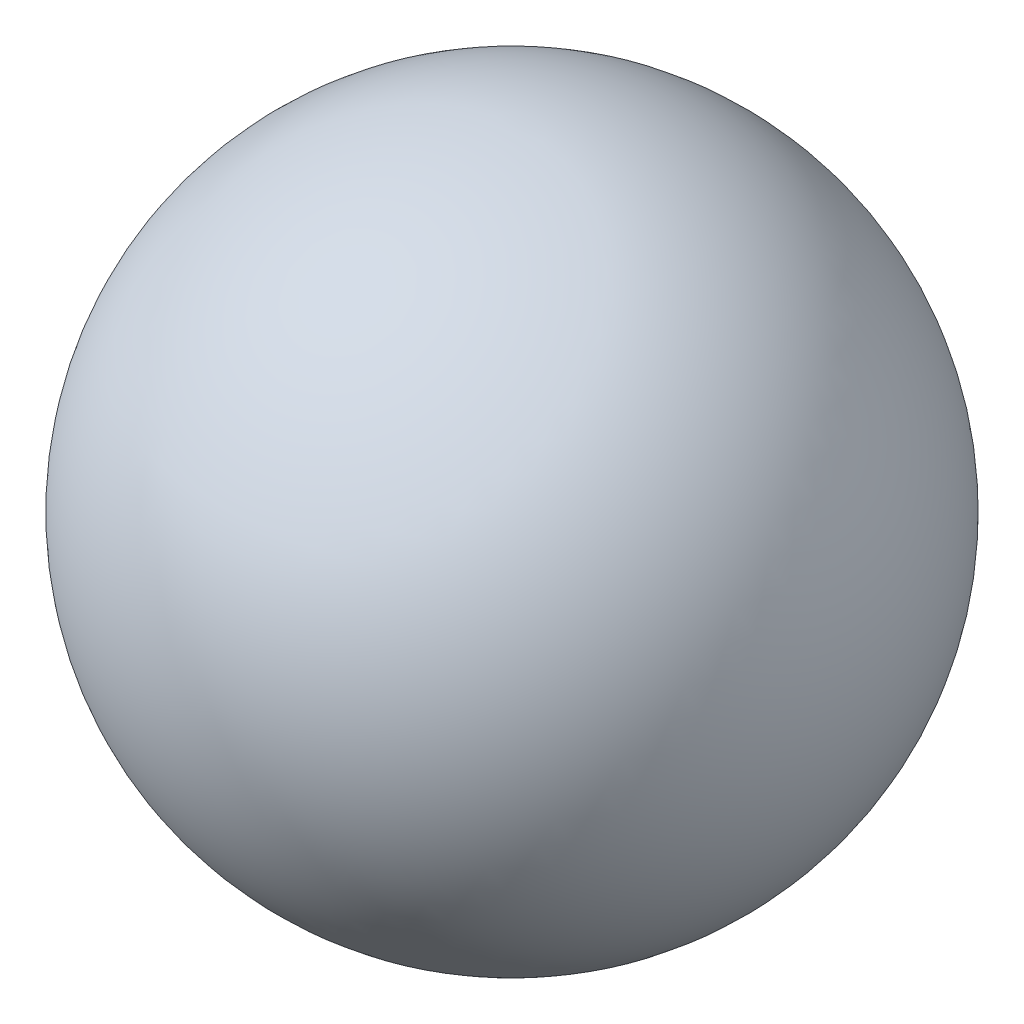
ISO-10303-21;
HEADER;
FILE_DESCRIPTION(('STEP AP214'),'2;1');
FILE_NAME('part.step','',(''),(''),'','','');
FILE_SCHEMA(('AUTOMOTIVE_DESIGN { 1 0 10303 214 1 1 1 1 }'));
ENDSEC;
DATA;
#1=APPLICATION_CONTEXT('core data for automotive mechanical design processes');
#2=APPLICATION_PROTOCOL_DEFINITION('international standard','automotive_design',2000,#1);
#3=PRODUCT_CONTEXT('',#1,'mechanical');
#4=PRODUCT('Part','Part','',(#3));
#5=PRODUCT_RELATED_PRODUCT_CATEGORY('part','',(#4));
#6=PRODUCT_DEFINITION_FORMATION('','',#4);
#7=PRODUCT_DEFINITION_CONTEXT('part definition',#1,'design');
#8=PRODUCT_DEFINITION('design','',#6,#7);
#9=PRODUCT_DEFINITION_SHAPE('','',#8);
#10=(LENGTH_UNIT() NAMED_UNIT(*) SI_UNIT(.MILLI.,.METRE.));
#11=(NAMED_UNIT(*) PLANE_ANGLE_UNIT() SI_UNIT($,.RADIAN.));
#12=(NAMED_UNIT(*) SI_UNIT($,.STERADIAN.) SOLID_ANGLE_UNIT());
#13=UNCERTAINTY_MEASURE_WITH_UNIT(LENGTH_MEASURE(1.E-05),#10,'distance_accuracy_value','');
#14=(GEOMETRIC_REPRESENTATION_CONTEXT(3) GLOBAL_UNCERTAINTY_ASSIGNED_CONTEXT((#13)) GLOBAL_UNIT_ASSIGNED_CONTEXT((#10,
#11,#12)) REPRESENTATION_CONTEXT('',''));
#15=CARTESIAN_POINT('',(0.,0.,0.));
#16=DIRECTION('',(0.,0.,1.));
#17=DIRECTION('',(1.,0.,0.));
#18=AXIS2_PLACEMENT_3D('',#15,#16,#17);
#19=CARTESIAN_POINT('',(2.,6.,0.));
#20=DIRECTION('',(0.,-1.,0.));
#21=DIRECTION('',(-1.,0.,0.));
#22=AXIS2_PLACEMENT_3D('',#19,#20,#21);
#23=SPHERICAL_SURFACE('',#22,1.4);
#24=CARTESIAN_POINT('',(2.,4.6,0.));
#25=VERTEX_POINT('',#24);
#26=VERTEX_LOOP('',#25);
#27=FACE_BOUND('',#26,.T.);
#28=ADVANCED_FACE('F27',(#27),#23,.T.);
#29=CLOSED_SHELL('',(#28));
#30=MANIFOLD_SOLID_BREP('B2',#29);
#31=ADVANCED_BREP_SHAPE_REPRESENTATION('',(#18,#30),#14);
#32=SHAPE_DEFINITION_REPRESENTATION(#9,#31);
ENDSEC;
END-ISO-10303-21;
